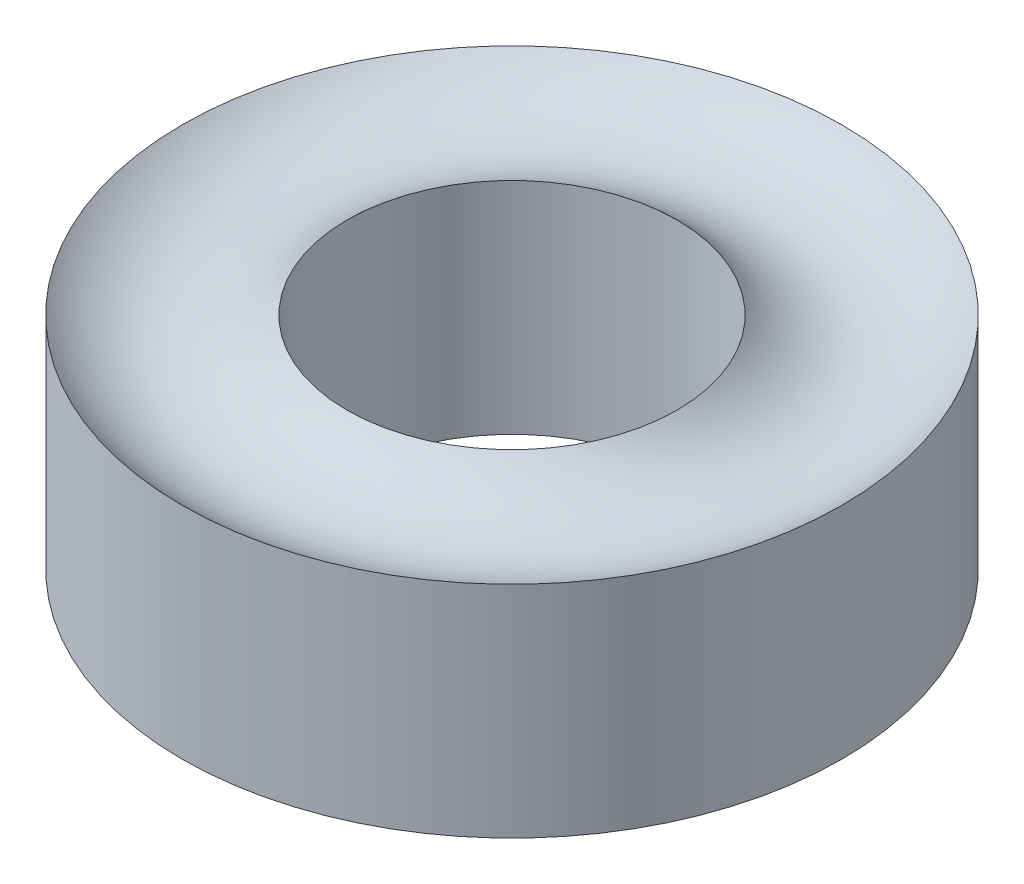
ISO-10303-21;
HEADER;
FILE_DESCRIPTION(('STEP AP214'),'2;1');
FILE_NAME('part.step','',(''),(''),'','','');
FILE_SCHEMA(('AUTOMOTIVE_DESIGN { 1 0 10303 214 1 1 1 1 }'));
ENDSEC;
DATA;
#1=APPLICATION_CONTEXT('core data for automotive mechanical design processes');
#2=APPLICATION_PROTOCOL_DEFINITION('international standard','automotive_design',2000,#1);
#3=PRODUCT_CONTEXT('',#1,'mechanical');
#4=PRODUCT('Part','Part','',(#3));
#5=PRODUCT_RELATED_PRODUCT_CATEGORY('part','',(#4));
#6=PRODUCT_DEFINITION_FORMATION('','',#4);
#7=PRODUCT_DEFINITION_CONTEXT('part definition',#1,'design');
#8=PRODUCT_DEFINITION('design','',#6,#7);
#9=PRODUCT_DEFINITION_SHAPE('','',#8);
#10=(LENGTH_UNIT() NAMED_UNIT(*) SI_UNIT(.MILLI.,.METRE.));
#11=(NAMED_UNIT(*) PLANE_ANGLE_UNIT() SI_UNIT($,.RADIAN.));
#12=(NAMED_UNIT(*) SI_UNIT($,.STERADIAN.) SOLID_ANGLE_UNIT());
#13=UNCERTAINTY_MEASURE_WITH_UNIT(LENGTH_MEASURE(1.E-05),#10,'distance_accuracy_value','');
#14=(GEOMETRIC_REPRESENTATION_CONTEXT(3) GLOBAL_UNCERTAINTY_ASSIGNED_CONTEXT((#13)) GLOBAL_UNIT_ASSIGNED_CONTEXT((#10,
#11,#12)) REPRESENTATION_CONTEXT('',''));
#15=CARTESIAN_POINT('',(0.,0.,0.));
#16=DIRECTION('',(0.,0.,1.));
#17=DIRECTION('',(1.,0.,0.));
#18=AXIS2_PLACEMENT_3D('',#15,#16,#17);
#19=CARTESIAN_POINT('',(0.,2.75,0.));
#20=DIRECTION('',(0.,-1.,0.));
#21=DIRECTION('',(0.,0.,-1.));
#22=AXIS2_PLACEMENT_3D('',#19,#20,#21);
#23=TOROIDAL_SURFACE('',#22,2.25,1.06066017177982);
#24=CARTESIAN_POINT('',(0.,2.,0.));
#25=DIRECTION('',(0.,-1.,0.));
#26=DIRECTION('',(0.,0.,-1.));
#27=AXIS2_PLACEMENT_3D('',#24,#25,#26);
#28=CIRCLE('',#27,1.5);
#29=CARTESIAN_POINT('',(0.,2.,-1.5));
#30=VERTEX_POINT('',#29);
#31=EDGE_CURVE('E10',#30,#30,#28,.T.);
#32=ORIENTED_EDGE('',*,*,#31,.T.);
#33=EDGE_LOOP('',(#32));
#34=FACE_BOUND('',#33,.T.);
#35=CARTESIAN_POINT('',(0.,2.,0.));
#36=DIRECTION('',(0.,-1.,0.));
#37=DIRECTION('',(0.,0.,-1.));
#38=AXIS2_PLACEMENT_3D('',#35,#36,#37);
#39=CIRCLE('',#38,3.);
#40=CARTESIAN_POINT('',(0.,2.,-3.));
#41=VERTEX_POINT('',#40);
#42=EDGE_CURVE('E43',#41,#41,#39,.T.);
#43=ORIENTED_EDGE('',*,*,#42,.F.);
#44=EDGE_LOOP('',(#43));
#45=FACE_BOUND('',#44,.T.);
#46=ADVANCED_FACE('F29',(#34,#45),#23,.F.);
#47=CARTESIAN_POINT('',(0.,0.,0.));
#48=DIRECTION('',(0.,-1.,0.));
#49=DIRECTION('',(0.,0.,-1.));
#50=AXIS2_PLACEMENT_3D('',#47,#48,#49);
#51=CYLINDRICAL_SURFACE('',#50,1.5);
#52=CARTESIAN_POINT('',(0.,0.,0.));
#53=DIRECTION('',(0.,-1.,0.));
#54=DIRECTION('',(0.,0.,-1.));
#55=AXIS2_PLACEMENT_3D('',#52,#53,#54);
#56=CIRCLE('',#55,1.5);
#57=CARTESIAN_POINT('',(0.,0.,-1.5));
#58=VERTEX_POINT('',#57);
#59=EDGE_CURVE('E35',#58,#58,#56,.T.);
#60=ORIENTED_EDGE('',*,*,#59,.T.);
#61=EDGE_LOOP('',(#60));
#62=FACE_BOUND('',#61,.T.);
#63=ORIENTED_EDGE('',*,*,#31,.F.);
#64=EDGE_LOOP('',(#63));
#65=FACE_BOUND('',#64,.T.);
#66=ADVANCED_FACE('F53',(#62,#65),#51,.F.);
#67=CARTESIAN_POINT('',(0.,-0.750000000000003,0.));
#68=DIRECTION('',(0.,-1.,0.));
#69=DIRECTION('',(0.,0.,-1.));
#70=AXIS2_PLACEMENT_3D('',#67,#68,#69);
#71=TOROIDAL_SURFACE('',#70,2.25,1.06066017177982);
#72=CARTESIAN_POINT('',(0.,0.,0.));
#73=DIRECTION('',(0.,-1.,0.));
#74=DIRECTION('',(0.,0.,-1.));
#75=AXIS2_PLACEMENT_3D('',#72,#73,#74);
#76=CIRCLE('',#75,3.);
#77=CARTESIAN_POINT('',(0.,0.,-3.));
#78=VERTEX_POINT('',#77);
#79=EDGE_CURVE('E39',#78,#78,#76,.T.);
#80=ORIENTED_EDGE('',*,*,#79,.T.);
#81=EDGE_LOOP('',(#80));
#82=FACE_BOUND('',#81,.T.);
#83=ORIENTED_EDGE('',*,*,#59,.F.);
#84=EDGE_LOOP('',(#83));
#85=FACE_BOUND('',#84,.T.);
#86=ADVANCED_FACE('F57',(#82,#85),#71,.F.);
#87=CARTESIAN_POINT('',(0.,0.,0.));
#88=DIRECTION('',(0.,-1.,0.));
#89=DIRECTION('',(0.,0.,-1.));
#90=AXIS2_PLACEMENT_3D('',#87,#88,#89);
#91=CYLINDRICAL_SURFACE('',#90,3.);
#92=ORIENTED_EDGE('',*,*,#42,.T.);
#93=EDGE_LOOP('',(#92));
#94=FACE_BOUND('',#93,.T.);
#95=ORIENTED_EDGE('',*,*,#79,.F.);
#96=EDGE_LOOP('',(#95));
#97=FACE_BOUND('',#96,.T.);
#98=ADVANCED_FACE('F49',(#94,#97),#91,.T.);
#99=CLOSED_SHELL('',(#46,#66,#86,#98));
#100=MANIFOLD_SOLID_BREP('B2',#99);
#101=ADVANCED_BREP_SHAPE_REPRESENTATION('',(#18,#100),#14);
#102=SHAPE_DEFINITION_REPRESENTATION(#9,#101);
ENDSEC;
END-ISO-10303-21;
